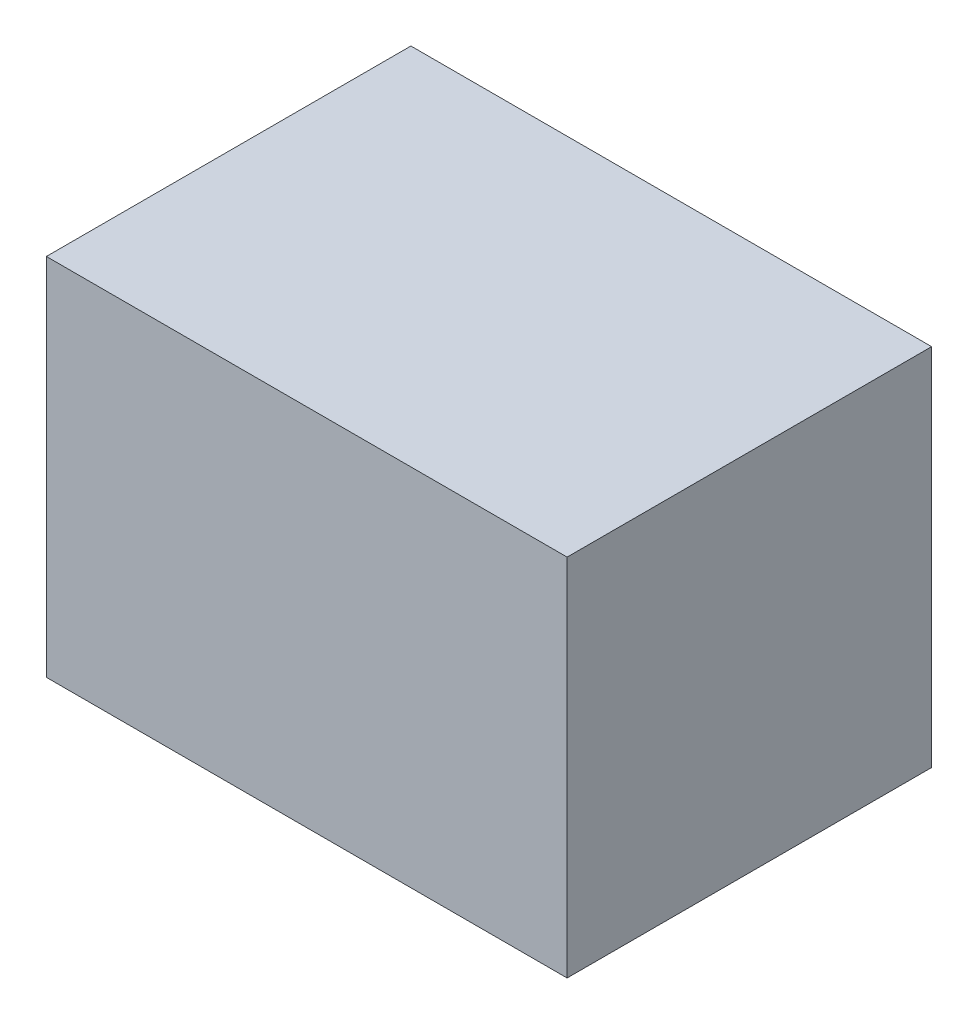
ISO-10303-21;
HEADER;
FILE_DESCRIPTION(('STEP AP214'),'2;1');
FILE_NAME('part.step','',(''),(''),'','','');
FILE_SCHEMA(('AUTOMOTIVE_DESIGN { 1 0 10303 214 1 1 1 1 }'));
ENDSEC;
DATA;
#1=APPLICATION_CONTEXT('core data for automotive mechanical design processes');
#2=APPLICATION_PROTOCOL_DEFINITION('international standard','automotive_design',2000,#1);
#3=PRODUCT_CONTEXT('',#1,'mechanical');
#4=PRODUCT('Part','Part','',(#3));
#5=PRODUCT_RELATED_PRODUCT_CATEGORY('part','',(#4));
#6=PRODUCT_DEFINITION_FORMATION('','',#4);
#7=PRODUCT_DEFINITION_CONTEXT('part definition',#1,'design');
#8=PRODUCT_DEFINITION('design','',#6,#7);
#9=PRODUCT_DEFINITION_SHAPE('','',#8);
#10=(LENGTH_UNIT() NAMED_UNIT(*) SI_UNIT(.MILLI.,.METRE.));
#11=(NAMED_UNIT(*) PLANE_ANGLE_UNIT() SI_UNIT($,.RADIAN.));
#12=(NAMED_UNIT(*) SI_UNIT($,.STERADIAN.) SOLID_ANGLE_UNIT());
#13=UNCERTAINTY_MEASURE_WITH_UNIT(LENGTH_MEASURE(1.E-05),#10,'distance_accuracy_value','');
#14=(GEOMETRIC_REPRESENTATION_CONTEXT(3) GLOBAL_UNCERTAINTY_ASSIGNED_CONTEXT((#13)) GLOBAL_UNIT_ASSIGNED_CONTEXT((#10,
#11,#12)) REPRESENTATION_CONTEXT('',''));
#15=CARTESIAN_POINT('',(0.,0.,0.));
#16=DIRECTION('',(0.,0.,1.));
#17=DIRECTION('',(1.,0.,0.));
#18=AXIS2_PLACEMENT_3D('',#15,#16,#17);
#19=CARTESIAN_POINT('',(-22.86,0.,0.));
#20=DIRECTION('',(0.,-1.,0.));
#21=DIRECTION('',(0.,0.,-1.));
#22=AXIS2_PLACEMENT_3D('',#19,#20,#21);
#23=PLANE('',#22);
#24=DIRECTION('',(1.,0.,0.));
#25=VECTOR('',#24,1.);
#26=CARTESIAN_POINT('',(-22.86,0.,-1.1));
#27=LINE('',#26,#25);
#28=CARTESIAN_POINT('',(-7.87,0.,-1.1));
#29=VERTEX_POINT('',#28);
#30=CARTESIAN_POINT('',(-7.37,0.,-1.1));
#31=VERTEX_POINT('',#30);
#32=EDGE_CURVE('E115',#29,#31,#27,.T.);
#33=ORIENTED_EDGE('',*,*,#32,.F.);
#34=DIRECTION('',(0.,0.,1.));
#35=VECTOR('',#34,1.);
#36=CARTESIAN_POINT('',(-7.87,0.,0.));
#37=LINE('',#36,#35);
#38=CARTESIAN_POINT('',(-7.87,0.,-0.75));
#39=VERTEX_POINT('',#38);
#40=EDGE_CURVE('E28',#29,#39,#37,.T.);
#41=ORIENTED_EDGE('',*,*,#40,.T.);
#42=DIRECTION('',(1.,0.,0.));
#43=VECTOR('',#42,1.);
#44=CARTESIAN_POINT('',(-22.86,0.,-0.75));
#45=LINE('',#44,#43);
#46=CARTESIAN_POINT('',(-7.37,0.,-0.75));
#47=VERTEX_POINT('',#46);
#48=EDGE_CURVE('E86',#39,#47,#45,.T.);
#49=ORIENTED_EDGE('',*,*,#48,.T.);
#50=DIRECTION('',(0.,0.,1.));
#51=VECTOR('',#50,1.);
#52=CARTESIAN_POINT('',(-7.37,0.,0.));
#53=LINE('',#52,#51);
#54=EDGE_CURVE('E90',#31,#47,#53,.T.);
#55=ORIENTED_EDGE('',*,*,#54,.F.);
#56=EDGE_LOOP('',(#33,#41,#49,#55));
#57=FACE_BOUND('',#56,.T.);
#58=ADVANCED_FACE('F17',(#57),#23,.F.);
#59=CARTESIAN_POINT('',(-22.86,-0.35,0.));
#60=DIRECTION('',(0.,-1.,0.));
#61=DIRECTION('',(0.,0.,-1.));
#62=AXIS2_PLACEMENT_3D('',#59,#60,#61);
#63=PLANE('',#62);
#64=DIRECTION('',(1.,0.,0.));
#65=VECTOR('',#64,1.);
#66=CARTESIAN_POINT('',(-22.86,-0.35,-1.1));
#67=LINE('',#66,#65);
#68=CARTESIAN_POINT('',(-7.87,-0.35,-1.1));
#69=VERTEX_POINT('',#68);
#70=CARTESIAN_POINT('',(-7.37,-0.35,-1.1));
#71=VERTEX_POINT('',#70);
#72=EDGE_CURVE('E81',#69,#71,#67,.T.);
#73=ORIENTED_EDGE('',*,*,#72,.T.);
#74=DIRECTION('',(0.,0.,1.));
#75=VECTOR('',#74,1.);
#76=CARTESIAN_POINT('',(-7.37,-0.35,0.));
#77=LINE('',#76,#75);
#78=CARTESIAN_POINT('',(-7.37,-0.35,-0.75));
#79=VERTEX_POINT('',#78);
#80=EDGE_CURVE('E78',#71,#79,#77,.T.);
#81=ORIENTED_EDGE('',*,*,#80,.T.);
#82=DIRECTION('',(1.,0.,0.));
#83=VECTOR('',#82,1.);
#84=CARTESIAN_POINT('',(-22.86,-0.35,-0.75));
#85=LINE('',#84,#83);
#86=CARTESIAN_POINT('',(-7.87,-0.35,-0.75));
#87=VERTEX_POINT('',#86);
#88=EDGE_CURVE('E68',#87,#79,#85,.T.);
#89=ORIENTED_EDGE('',*,*,#88,.F.);
#90=DIRECTION('',(0.,0.,1.));
#91=VECTOR('',#90,1.);
#92=CARTESIAN_POINT('',(-7.87,-0.35,0.));
#93=LINE('',#92,#91);
#94=EDGE_CURVE('E11',#69,#87,#93,.T.);
#95=ORIENTED_EDGE('',*,*,#94,.F.);
#96=EDGE_LOOP('',(#73,#81,#89,#95));
#97=FACE_BOUND('',#96,.T.);
#98=ADVANCED_FACE('F79',(#97),#63,.T.);
#99=CARTESIAN_POINT('',(-7.87,-0.35,0.));
#100=DIRECTION('',(-1.,0.,0.));
#101=DIRECTION('',(0.,0.,1.));
#102=AXIS2_PLACEMENT_3D('',#99,#100,#101);
#103=PLANE('',#102);
#104=ORIENTED_EDGE('',*,*,#40,.F.);
#105=DIRECTION('',(0.,1.,0.));
#106=VECTOR('',#105,1.);
#107=CARTESIAN_POINT('',(-7.87,-0.35,-1.1));
#108=LINE('',#107,#106);
#109=EDGE_CURVE('E97',#69,#29,#108,.T.);
#110=ORIENTED_EDGE('',*,*,#109,.F.);
#111=ORIENTED_EDGE('',*,*,#94,.T.);
#112=DIRECTION('',(0.,1.,0.));
#113=VECTOR('',#112,1.);
#114=CARTESIAN_POINT('',(-7.87,-0.35,-0.75));
#115=LINE('',#114,#113);
#116=EDGE_CURVE('E74',#87,#39,#115,.T.);
#117=ORIENTED_EDGE('',*,*,#116,.T.);
#118=EDGE_LOOP('',(#104,#110,#111,#117));
#119=FACE_BOUND('',#118,.T.);
#120=ADVANCED_FACE('F154',(#119),#103,.T.);
#121=CARTESIAN_POINT('',(-22.86,-0.35,-0.75));
#122=DIRECTION('',(0.,0.,1.));
#123=DIRECTION('',(1.,0.,0.));
#124=AXIS2_PLACEMENT_3D('',#121,#122,#123);
#125=PLANE('',#124);
#126=ORIENTED_EDGE('',*,*,#48,.F.);
#127=ORIENTED_EDGE('',*,*,#116,.F.);
#128=ORIENTED_EDGE('',*,*,#88,.T.);
#129=DIRECTION('',(0.,1.,0.));
#130=VECTOR('',#129,1.);
#131=CARTESIAN_POINT('',(-7.37,-0.35,-0.75));
#132=LINE('',#131,#130);
#133=EDGE_CURVE('E72',#79,#47,#132,.T.);
#134=ORIENTED_EDGE('',*,*,#133,.T.);
#135=EDGE_LOOP('',(#126,#127,#128,#134));
#136=FACE_BOUND('',#135,.T.);
#137=ADVANCED_FACE('F19',(#136),#125,.T.);
#138=CARTESIAN_POINT('',(-7.37,-0.35,0.));
#139=DIRECTION('',(-1.,0.,0.));
#140=DIRECTION('',(0.,0.,1.));
#141=AXIS2_PLACEMENT_3D('',#138,#139,#140);
#142=PLANE('',#141);
#143=ORIENTED_EDGE('',*,*,#54,.T.);
#144=ORIENTED_EDGE('',*,*,#133,.F.);
#145=ORIENTED_EDGE('',*,*,#80,.F.);
#146=DIRECTION('',(0.,1.,0.));
#147=VECTOR('',#146,1.);
#148=CARTESIAN_POINT('',(-7.37,-0.35,-1.1));
#149=LINE('',#148,#147);
#150=EDGE_CURVE('E21',#71,#31,#149,.T.);
#151=ORIENTED_EDGE('',*,*,#150,.T.);
#152=EDGE_LOOP('',(#143,#144,#145,#151));
#153=FACE_BOUND('',#152,.T.);
#154=ADVANCED_FACE('F88',(#153),#142,.F.);
#155=CARTESIAN_POINT('',(-22.86,-0.35,-1.1));
#156=DIRECTION('',(0.,0.,1.));
#157=DIRECTION('',(1.,0.,0.));
#158=AXIS2_PLACEMENT_3D('',#155,#156,#157);
#159=PLANE('',#158);
#160=ORIENTED_EDGE('',*,*,#32,.T.);
#161=ORIENTED_EDGE('',*,*,#150,.F.);
#162=ORIENTED_EDGE('',*,*,#72,.F.);
#163=ORIENTED_EDGE('',*,*,#109,.T.);
#164=EDGE_LOOP('',(#160,#161,#162,#163));
#165=FACE_BOUND('',#164,.T.);
#166=ADVANCED_FACE('F146',(#165),#159,.F.);
#167=CLOSED_SHELL('',(#58,#98,#120,#137,#154,#166));
#168=MANIFOLD_SOLID_BREP('B1',#167);
#169=ADVANCED_BREP_SHAPE_REPRESENTATION('',(#18,#168),#14);
#170=SHAPE_DEFINITION_REPRESENTATION(#9,#169);
ENDSEC;
END-ISO-10303-21;
